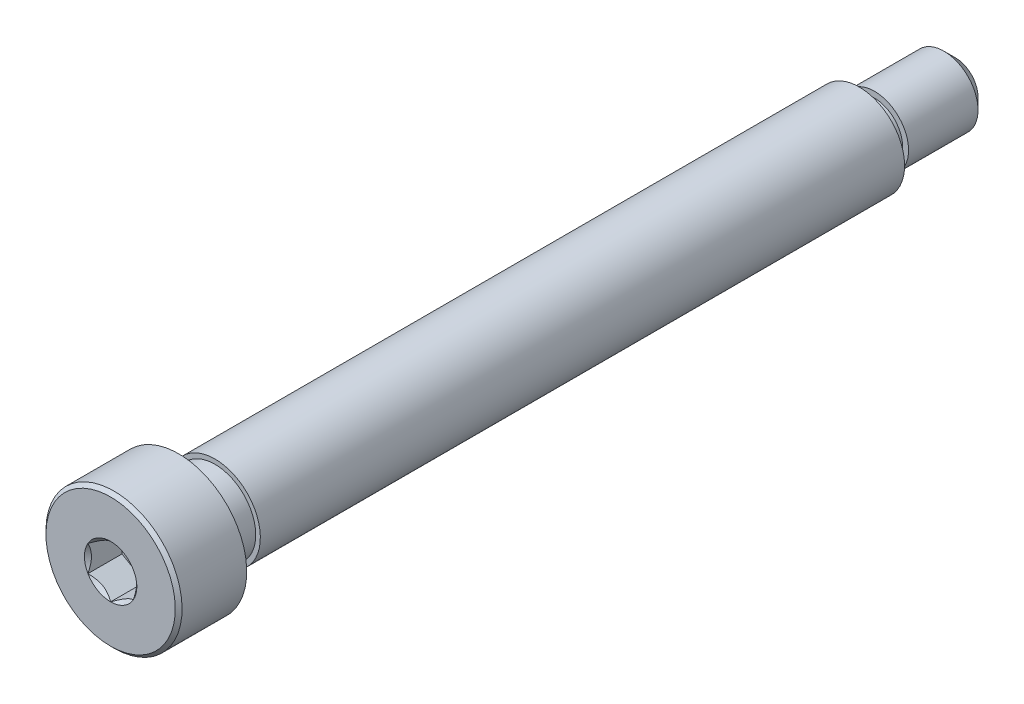
ISO-10303-21;
HEADER;
FILE_DESCRIPTION(('STEP AP214'),'2;1');
FILE_NAME('part.step','',(''),(''),'','','');
FILE_SCHEMA(('AUTOMOTIVE_DESIGN { 1 0 10303 214 1 1 1 1 }'));
ENDSEC;
DATA;
#1=APPLICATION_CONTEXT('core data for automotive mechanical design processes');
#2=APPLICATION_PROTOCOL_DEFINITION('international standard','automotive_design',2000,#1);
#3=PRODUCT_CONTEXT('',#1,'mechanical');
#4=PRODUCT('Part','Part','',(#3));
#5=PRODUCT_RELATED_PRODUCT_CATEGORY('part','',(#4));
#6=PRODUCT_DEFINITION_FORMATION('','',#4);
#7=PRODUCT_DEFINITION_CONTEXT('part definition',#1,'design');
#8=PRODUCT_DEFINITION('design','',#6,#7);
#9=PRODUCT_DEFINITION_SHAPE('','',#8);
#10=(LENGTH_UNIT() NAMED_UNIT(*) SI_UNIT(.MILLI.,.METRE.));
#11=(NAMED_UNIT(*) PLANE_ANGLE_UNIT() SI_UNIT($,.RADIAN.));
#12=(NAMED_UNIT(*) SI_UNIT($,.STERADIAN.) SOLID_ANGLE_UNIT());
#13=UNCERTAINTY_MEASURE_WITH_UNIT(LENGTH_MEASURE(1.E-05),#10,'distance_accuracy_value','');
#14=(GEOMETRIC_REPRESENTATION_CONTEXT(3) GLOBAL_UNCERTAINTY_ASSIGNED_CONTEXT((#13)) GLOBAL_UNIT_ASSIGNED_CONTEXT((#10,
#11,#12)) REPRESENTATION_CONTEXT('',''));
#15=CARTESIAN_POINT('',(0.,0.,0.));
#16=DIRECTION('',(0.,0.,1.));
#17=DIRECTION('',(1.,0.,0.));
#18=AXIS2_PLACEMENT_3D('',#15,#16,#17);
#19=CARTESIAN_POINT('',(0.,0.,18.621));
#20=DIRECTION('',(0.,0.,1.));
#21=DIRECTION('',(0.,-1.,0.));
#22=AXIS2_PLACEMENT_3D('',#19,#20,#21);
#23=CYLINDRICAL_SURFACE('',#22,3.);
#24=CARTESIAN_POINT('',(0.,0.,15.621));
#25=DIRECTION('',(0.,0.,1.));
#26=DIRECTION('',(0.,-1.,0.));
#27=AXIS2_PLACEMENT_3D('',#24,#25,#26);
#28=CIRCLE('',#27,3.);
#29=CARTESIAN_POINT('',(0.,-3.,15.621));
#30=VERTEX_POINT('',#29);
#31=EDGE_CURVE('E172',#30,#30,#28,.T.);
#32=ORIENTED_EDGE('',*,*,#31,.T.);
#33=EDGE_LOOP('',(#32));
#34=FACE_BOUND('',#33,.T.);
#35=CARTESIAN_POINT('',(0.,0.,18.471));
#36=DIRECTION('',(0.,0.,1.));
#37=DIRECTION('',(0.,-1.,0.));
#38=AXIS2_PLACEMENT_3D('',#35,#36,#37);
#39=CIRCLE('',#38,3.);
#40=CARTESIAN_POINT('',(0.,-3.,18.471));
#41=VERTEX_POINT('',#40);
#42=EDGE_CURVE('E425',#41,#41,#39,.T.);
#43=ORIENTED_EDGE('',*,*,#42,.F.);
#44=EDGE_LOOP('',(#43));
#45=FACE_BOUND('',#44,.T.);
#46=ADVANCED_FACE('F45',(#34,#45),#23,.T.);
#47=CARTESIAN_POINT('',(0.,2.,-14.379));
#48=DIRECTION('',(0.,0.,1.));
#49=DIRECTION('',(0.,-1.,0.));
#50=AXIS2_PLACEMENT_3D('',#47,#48,#49);
#51=PLANE('',#50);
#52=CARTESIAN_POINT('',(0.,0.,-14.379));
#53=DIRECTION('',(0.,0.,1.));
#54=DIRECTION('',(0.,-1.,0.));
#55=AXIS2_PLACEMENT_3D('',#52,#53,#54);
#56=CIRCLE('',#55,1.36904775);
#57=CARTESIAN_POINT('',(0.,-1.36904775,-14.379));
#58=VERTEX_POINT('',#57);
#59=EDGE_CURVE('E145',#58,#58,#56,.T.);
#60=ORIENTED_EDGE('',*,*,#59,.T.);
#61=EDGE_LOOP('',(#60));
#62=FACE_BOUND('',#61,.T.);
#63=CARTESIAN_POINT('',(0.,0.,-14.379));
#64=DIRECTION('',(0.,0.,1.));
#65=DIRECTION('',(0.,-1.,0.));
#66=AXIS2_PLACEMENT_3D('',#63,#64,#65);
#67=CIRCLE('',#66,1.5);
#68=CARTESIAN_POINT('',(0.,-1.5,-14.379));
#69=VERTEX_POINT('',#68);
#70=EDGE_CURVE('E165',#69,#69,#67,.T.);
#71=ORIENTED_EDGE('',*,*,#70,.F.);
#72=EDGE_LOOP('',(#71));
#73=FACE_BOUND('',#72,.T.);
#74=ADVANCED_FACE('F255',(#62,#73),#51,.F.);
#75=CARTESIAN_POINT('',(0.,1.5,-18.621));
#76=DIRECTION('',(0.,0.,1.));
#77=DIRECTION('',(0.,-1.,0.));
#78=AXIS2_PLACEMENT_3D('',#75,#76,#77);
#79=PLANE('',#78);
#80=CARTESIAN_POINT('',(0.,0.,-18.621));
#81=DIRECTION('',(0.,0.,1.));
#82=DIRECTION('',(0.,-1.,0.));
#83=AXIS2_PLACEMENT_3D('',#80,#81,#82);
#84=CIRCLE('',#83,0.993851983499987);
#85=CARTESIAN_POINT('',(0.,-0.993851983499987,-18.621));
#86=VERTEX_POINT('',#85);
#87=EDGE_CURVE('E12',#86,#86,#84,.F.);
#88=ORIENTED_EDGE('',*,*,#87,.T.);
#89=EDGE_LOOP('',(#88));
#90=FACE_BOUND('',#89,.T.);
#91=ADVANCED_FACE('F263',(#90),#79,.F.);
#92=CARTESIAN_POINT('',(0.,0.,18.621));
#93=DIRECTION('',(0.,0.,1.));
#94=DIRECTION('',(0.,-1.,0.));
#95=AXIS2_PLACEMENT_3D('',#92,#93,#94);
#96=CYLINDRICAL_SURFACE('',#95,1.5);
#97=CARTESIAN_POINT('',(0.,0.,-18.1148519835));
#98=DIRECTION('',(0.,0.,1.));
#99=DIRECTION('',(0.,-1.,0.));
#100=AXIS2_PLACEMENT_3D('',#97,#98,#99);
#101=CIRCLE('',#100,1.5);
#102=CARTESIAN_POINT('',(0.,-1.5,-18.1148519835));
#103=VERTEX_POINT('',#102);
#104=EDGE_CURVE('E53',#103,#103,#101,.T.);
#105=ORIENTED_EDGE('',*,*,#104,.T.);
#106=EDGE_LOOP('',(#105));
#107=FACE_BOUND('',#106,.T.);
#108=CARTESIAN_POINT('',(0.,0.,-15.053864022));
#109=DIRECTION('',(0.,0.,1.));
#110=DIRECTION('',(0.,-1.,0.));
#111=AXIS2_PLACEMENT_3D('',#108,#109,#110);
#112=CIRCLE('',#111,1.5);
#113=CARTESIAN_POINT('',(0.,-1.5,-15.053864022));
#114=VERTEX_POINT('',#113);
#115=EDGE_CURVE('E156',#114,#114,#112,.T.);
#116=ORIENTED_EDGE('',*,*,#115,.F.);
#117=EDGE_LOOP('',(#116));
#118=FACE_BOUND('',#117,.T.);
#119=ADVANCED_FACE('F448',(#107,#118),#96,.T.);
#120=CARTESIAN_POINT('',(0.,1.2380955,-15.053864022));
#121=DIRECTION('',(0.,0.,-1.));
#122=DIRECTION('',(0.,1.,0.));
#123=AXIS2_PLACEMENT_3D('',#120,#121,#122);
#124=PLANE('',#123);
#125=CARTESIAN_POINT('',(0.,0.,-15.053864022));
#126=DIRECTION('',(0.,0.,1.));
#127=DIRECTION('',(0.,-1.,0.));
#128=AXIS2_PLACEMENT_3D('',#125,#126,#127);
#129=CIRCLE('',#128,1.2380955);
#130=CARTESIAN_POINT('',(0.,-1.2380955,-15.053864022));
#131=VERTEX_POINT('',#130);
#132=EDGE_CURVE('E159',#131,#131,#129,.T.);
#133=ORIENTED_EDGE('',*,*,#132,.F.);
#134=EDGE_LOOP('',(#133));
#135=FACE_BOUND('',#134,.T.);
#136=ORIENTED_EDGE('',*,*,#115,.T.);
#137=EDGE_LOOP('',(#136));
#138=FACE_BOUND('',#137,.T.);
#139=ADVANCED_FACE('F302',(#135,#138),#124,.F.);
#140=CARTESIAN_POINT('',(0.,0.,18.621));
#141=DIRECTION('',(0.,0.,1.));
#142=DIRECTION('',(0.,-1.,0.));
#143=AXIS2_PLACEMENT_3D('',#140,#141,#142);
#144=CYLINDRICAL_SURFACE('',#143,1.2380955);
#145=CARTESIAN_POINT('',(0.,0.,-14.50995225));
#146=DIRECTION('',(0.,0.,1.));
#147=DIRECTION('',(0.,-1.,0.));
#148=AXIS2_PLACEMENT_3D('',#145,#146,#147);
#149=CIRCLE('',#148,1.2380955);
#150=CARTESIAN_POINT('',(0.,-1.2380955,-14.50995225));
#151=VERTEX_POINT('',#150);
#152=EDGE_CURVE('E162',#151,#151,#149,.T.);
#153=ORIENTED_EDGE('',*,*,#152,.F.);
#154=EDGE_LOOP('',(#153));
#155=FACE_BOUND('',#154,.T.);
#156=ORIENTED_EDGE('',*,*,#132,.T.);
#157=EDGE_LOOP('',(#156));
#158=FACE_BOUND('',#157,.T.);
#159=ADVANCED_FACE('F289',(#155,#158),#144,.T.);
#160=CARTESIAN_POINT('',(0.,0.,-14.50995225));
#161=DIRECTION('',(0.,0.,1.));
#162=DIRECTION('',(0.,-1.,0.));
#163=AXIS2_PLACEMENT_3D('',#160,#161,#162);
#164=TOROIDAL_SURFACE('',#163,1.36904775,0.13095225);
#165=ORIENTED_EDGE('',*,*,#59,.F.);
#166=EDGE_LOOP('',(#165));
#167=FACE_BOUND('',#166,.T.);
#168=ORIENTED_EDGE('',*,*,#152,.T.);
#169=EDGE_LOOP('',(#168));
#170=FACE_BOUND('',#169,.T.);
#171=ADVANCED_FACE('F284',(#167,#170),#164,.F.);
#172=CARTESIAN_POINT('',(0.,0.,-14.379));
#173=DIRECTION('',(0.,0.,-1.));
#174=DIRECTION('',(0.,1.,0.));
#175=AXIS2_PLACEMENT_3D('',#172,#173,#174);
#176=CONICAL_SURFACE('',#175,1.5,1.56033896152627);
#177=CARTESIAN_POINT('',(0.,0.,-14.378601581645));
#178=DIRECTION('',(0.,0.,1.));
#179=DIRECTION('',(0.,-1.,0.));
#180=AXIS2_PLACEMENT_3D('',#177,#178,#179);
#181=CIRCLE('',#180,1.46190208322212);
#182=CARTESIAN_POINT('',(0.,-1.46190208322212,-14.378601581645));
#183=VERTEX_POINT('',#182);
#184=EDGE_CURVE('E175',#183,#183,#181,.T.);
#185=ORIENTED_EDGE('',*,*,#184,.F.);
#186=EDGE_LOOP('',(#185));
#187=FACE_BOUND('',#186,.T.);
#188=ORIENTED_EDGE('',*,*,#70,.T.);
#189=EDGE_LOOP('',(#188));
#190=FACE_BOUND('',#189,.T.);
#191=ADVANCED_FACE('F281',(#187,#190),#176,.T.);
#192=CARTESIAN_POINT('',(0.,0.,14.021398418355));
#193=DIRECTION('',(0.,0.,-1.));
#194=DIRECTION('',(0.,1.,0.));
#195=AXIS2_PLACEMENT_3D('',#192,#193,#194);
#196=CONICAL_SURFACE('',#195,1.75890208322212,1.56033896152627);
#197=CARTESIAN_POINT('',(0.,0.,14.021));
#198=DIRECTION('',(0.,0.,1.));
#199=DIRECTION('',(0.,-1.,0.));
#200=AXIS2_PLACEMENT_3D('',#197,#198,#199);
#201=CIRCLE('',#200,1.797);
#202=CARTESIAN_POINT('',(0.,-1.797,14.021));
#203=VERTEX_POINT('',#202);
#204=EDGE_CURVE('E171',#203,#203,#201,.T.);
#205=ORIENTED_EDGE('',*,*,#204,.F.);
#206=EDGE_LOOP('',(#205));
#207=FACE_BOUND('',#206,.T.);
#208=CARTESIAN_POINT('',(0.,0.,14.021398418355));
#209=DIRECTION('',(0.,0.,1.));
#210=DIRECTION('',(0.,-1.,0.));
#211=AXIS2_PLACEMENT_3D('',#208,#209,#210);
#212=CIRCLE('',#211,1.75890208322212);
#213=CARTESIAN_POINT('',(0.,-1.75890208322212,14.021398418355));
#214=VERTEX_POINT('',#213);
#215=EDGE_CURVE('E176',#214,#214,#212,.T.);
#216=ORIENTED_EDGE('',*,*,#215,.T.);
#217=EDGE_LOOP('',(#216));
#218=FACE_BOUND('',#217,.T.);
#219=ADVANCED_FACE('F277',(#207,#218),#196,.F.);
#220=CARTESIAN_POINT('',(0.,0.,14.021398418355));
#221=DIRECTION('',(0.,0.,1.));
#222=DIRECTION('',(0.,-1.,0.));
#223=AXIS2_PLACEMENT_3D('',#220,#221,#222);
#224=CONICAL_SURFACE('',#223,1.75890208322212,0.010457365268617);
#225=ORIENTED_EDGE('',*,*,#184,.T.);
#226=EDGE_LOOP('',(#225));
#227=FACE_BOUND('',#226,.T.);
#228=ORIENTED_EDGE('',*,*,#215,.F.);
#229=EDGE_LOOP('',(#228));
#230=FACE_BOUND('',#229,.T.);
#231=ADVANCED_FACE('F274',(#227,#230),#224,.T.);
#232=CARTESIAN_POINT('',(0.,3.,15.621));
#233=DIRECTION('',(0.,0.,1.));
#234=DIRECTION('',(0.,-1.,0.));
#235=AXIS2_PLACEMENT_3D('',#232,#233,#234);
#236=PLANE('',#235);
#237=ORIENTED_EDGE('',*,*,#31,.F.);
#238=EDGE_LOOP('',(#237));
#239=FACE_BOUND('',#238,.T.);
#240=CARTESIAN_POINT('',(0.,0.,15.621));
#241=DIRECTION('',(0.,0.,1.));
#242=DIRECTION('',(0.,-1.,0.));
#243=AXIS2_PLACEMENT_3D('',#240,#241,#242);
#244=CIRCLE('',#243,1.797);
#245=CARTESIAN_POINT('',(0.,-1.797,15.621));
#246=VERTEX_POINT('',#245);
#247=EDGE_CURVE('E168',#246,#246,#244,.T.);
#248=ORIENTED_EDGE('',*,*,#247,.T.);
#249=EDGE_LOOP('',(#248));
#250=FACE_BOUND('',#249,.T.);
#251=ADVANCED_FACE('F268',(#239,#250),#236,.F.);
#252=CARTESIAN_POINT('',(0.,0.,18.621));
#253=DIRECTION('',(0.,0.,1.));
#254=DIRECTION('',(0.,-1.,0.));
#255=AXIS2_PLACEMENT_3D('',#252,#253,#254);
#256=CYLINDRICAL_SURFACE('',#255,1.797);
#257=ORIENTED_EDGE('',*,*,#247,.F.);
#258=EDGE_LOOP('',(#257));
#259=FACE_BOUND('',#258,.T.);
#260=ORIENTED_EDGE('',*,*,#204,.T.);
#261=EDGE_LOOP('',(#260));
#262=FACE_BOUND('',#261,.T.);
#263=ADVANCED_FACE('F308',(#259,#262),#256,.T.);
#264=CARTESIAN_POINT('',(0.,0.,-18.1148519835));
#265=DIRECTION('',(0.,0.,1.));
#266=DIRECTION('',(0.,-1.,0.));
#267=AXIS2_PLACEMENT_3D('',#264,#265,#266);
#268=CONICAL_SURFACE('',#267,1.5,0.785398163397455);
#269=ORIENTED_EDGE('',*,*,#87,.F.);
#270=EDGE_LOOP('',(#269));
#271=FACE_BOUND('',#270,.T.);
#272=ORIENTED_EDGE('',*,*,#104,.F.);
#273=EDGE_LOOP('',(#272));
#274=FACE_BOUND('',#273,.T.);
#275=ADVANCED_FACE('F47',(#271,#274),#268,.T.);
#276=CARTESIAN_POINT('',(0.,0.,18.621));
#277=DIRECTION('',(0.,0.,-1.));
#278=DIRECTION('',(0.,1.,0.));
#279=AXIS2_PLACEMENT_3D('',#276,#277,#278);
#280=CONICAL_SURFACE('',#279,2.85,0.785398163397445);
#281=ORIENTED_EDGE('',*,*,#42,.T.);
#282=EDGE_LOOP('',(#281));
#283=FACE_BOUND('',#282,.T.);
#284=CARTESIAN_POINT('',(0.,0.,18.621));
#285=DIRECTION('',(0.,0.,1.));
#286=DIRECTION('',(0.,-1.,0.));
#287=AXIS2_PLACEMENT_3D('',#284,#285,#286);
#288=CIRCLE('',#287,2.85);
#289=CARTESIAN_POINT('',(0.,-2.85,18.621));
#290=VERTEX_POINT('',#289);
#291=EDGE_CURVE('E428',#290,#290,#288,.T.);
#292=ORIENTED_EDGE('',*,*,#291,.F.);
#293=EDGE_LOOP('',(#292));
#294=FACE_BOUND('',#293,.T.);
#295=ADVANCED_FACE('F201',(#283,#294),#280,.T.);
#296=CARTESIAN_POINT('',(0.,0.,17.121));
#297=DIRECTION('',(0.,0.,1.));
#298=DIRECTION('',(1.,0.,0.));
#299=AXIS2_PLACEMENT_3D('',#296,#297,#298);
#300=PLANE('',#299);
#301=DIRECTION('',(-0.866025403784439,0.499999999999999,0.));
#302=VECTOR('',#301,1.);
#303=CARTESIAN_POINT('',(1.,0.577350269189626,17.121));
#304=LINE('',#303,#302);
#305=CARTESIAN_POINT('',(1.,0.577350269189626,17.121));
#306=VERTEX_POINT('',#305);
#307=CARTESIAN_POINT('',(0.,1.15470053837925,17.121));
#308=VERTEX_POINT('',#307);
#309=EDGE_CURVE('E104',#306,#308,#304,.T.);
#310=ORIENTED_EDGE('',*,*,#309,.T.);
#311=DIRECTION('',(-0.866025403784438,-0.5,0.));
#312=VECTOR('',#311,1.);
#313=CARTESIAN_POINT('',(0.,1.15470053837925,17.121));
#314=LINE('',#313,#312);
#315=CARTESIAN_POINT('',(-1.,0.577350269189625,17.121));
#316=VERTEX_POINT('',#315);
#317=EDGE_CURVE('E114',#308,#316,#314,.T.);
#318=ORIENTED_EDGE('',*,*,#317,.T.);
#319=DIRECTION('',(0.,-1.,0.));
#320=VECTOR('',#319,1.);
#321=CARTESIAN_POINT('',(-1.,0.577350269189625,17.121));
#322=LINE('',#321,#320);
#323=CARTESIAN_POINT('',(-1.,-0.577350269189626,17.121));
#324=VERTEX_POINT('',#323);
#325=EDGE_CURVE('E120',#316,#324,#322,.T.);
#326=ORIENTED_EDGE('',*,*,#325,.T.);
#327=DIRECTION('',(0.866025403784439,-0.499999999999999,0.));
#328=VECTOR('',#327,1.);
#329=CARTESIAN_POINT('',(-1.,-0.577350269189626,17.121));
#330=LINE('',#329,#328);
#331=CARTESIAN_POINT('',(0.,-1.15470053837925,17.121));
#332=VERTEX_POINT('',#331);
#333=EDGE_CURVE('E137',#324,#332,#330,.T.);
#334=ORIENTED_EDGE('',*,*,#333,.T.);
#335=DIRECTION('',(0.866025403784438,0.5,0.));
#336=VECTOR('',#335,1.);
#337=CARTESIAN_POINT('',(0.,-1.15470053837925,17.121));
#338=LINE('',#337,#336);
#339=CARTESIAN_POINT('',(1.,-0.577350269189625,17.121));
#340=VERTEX_POINT('',#339);
#341=EDGE_CURVE('E140',#332,#340,#338,.T.);
#342=ORIENTED_EDGE('',*,*,#341,.T.);
#343=DIRECTION('',(0.,1.,0.));
#344=VECTOR('',#343,1.);
#345=CARTESIAN_POINT('',(1.,-0.577350269189625,17.121));
#346=LINE('',#345,#344);
#347=EDGE_CURVE('E111',#340,#306,#346,.T.);
#348=ORIENTED_EDGE('',*,*,#347,.T.);
#349=EDGE_LOOP('',(#310,#318,#326,#334,#342,#348));
#350=FACE_BOUND('',#349,.T.);
#351=ADVANCED_FACE('F122',(#350),#300,.T.);
#352=CARTESIAN_POINT('',(-1.,0.577350269189625,17.121));
#353=DIRECTION('',(-1.,0.,0.));
#354=DIRECTION('',(0.,-1.,0.));
#355=AXIS2_PLACEMENT_3D('',#352,#353,#354);
#356=PLANE('',#355);
#357=DIRECTION('',(0.,0.,1.));
#358=VECTOR('',#357,1.);
#359=CARTESIAN_POINT('',(-1.,0.577350269189625,17.121));
#360=LINE('',#359,#358);
#361=CARTESIAN_POINT('',(-0.999999999999999,0.577350269189626,18.621));
#362=VERTEX_POINT('',#361);
#363=EDGE_CURVE('E110',#316,#362,#360,.T.);
#364=ORIENTED_EDGE('',*,*,#363,.T.);
#365=CARTESIAN_POINT('',(-1.,-1.15147208646462,18.9913856775139));
#366=CARTESIAN_POINT('',(-1.,-1.12343447988552,18.9702199198737));
#367=CARTESIAN_POINT('',(-1.,-1.09524064850697,18.9492616921759));
#368=CARTESIAN_POINT('',(-1.,-1.03847715644376,18.9078460222356));
#369=CARTESIAN_POINT('',(-1.,-1.00990740382975,18.8873887061237));
#370=CARTESIAN_POINT('',(-1.,-0.923120894333479,18.8266047949545));
#371=CARTESIAN_POINT('',(-1.,-0.86425317375906,18.7871922289614));
#372=CARTESIAN_POINT('',(-1.,-0.740809858258045,18.7098206642002));
#373=CARTESIAN_POINT('',(-1.,-0.676100255137807,18.6720730391143));
#374=CARTESIAN_POINT('',(-1.,-0.543448939049125,18.6030245875513));
#375=CARTESIAN_POINT('',(-1.,-0.475519112027779,18.5717020278469));
#376=CARTESIAN_POINT('',(-1.,-0.373555850333529,18.5333817788838));
#377=CARTESIAN_POINT('',(-1.,-0.341031989670908,18.5223835916422));
#378=CARTESIAN_POINT('',(-1.,-0.275199079052293,18.5029983421474));
#379=CARTESIAN_POINT('',(-1.,-0.241889975173933,18.4946114597767));
#380=CARTESIAN_POINT('',(-1.,-0.175247517042993,18.481025220719));
#381=CARTESIAN_POINT('',(-1.,-0.141925568218175,18.475770790768));
#382=CARTESIAN_POINT('',(-1.,-0.0749144362322795,18.4685486865709));
#383=CARTESIAN_POINT('',(-1.,-0.0412251978501623,18.4665815136105));
#384=CARTESIAN_POINT('',(-1.,0.0249580992634202,18.4660831983932));
#385=CARTESIAN_POINT('',(-1.,0.0574512826460383,18.4674302678886));
#386=CARTESIAN_POINT('',(-1.,0.122148505701866,18.473216484499));
#387=CARTESIAN_POINT('',(-1.,0.154352610132925,18.4776549206615));
#388=CARTESIAN_POINT('',(-1.,0.218799898867638,18.4894568301452));
#389=CARTESIAN_POINT('',(-1.,0.251033743268952,18.4968705410385));
#390=CARTESIAN_POINT('',(-1.,0.314797132354918,18.5142289424987));
#391=CARTESIAN_POINT('',(-1.,0.346326735731003,18.5241734212888));
#392=CARTESIAN_POINT('',(-1.,0.445594187730204,18.5592234825543));
#393=CARTESIAN_POINT('',(-1.,0.511919139476036,18.5883208583567));
#394=CARTESIAN_POINT('',(-1.,0.641453244657532,18.6530153296865));
#395=CARTESIAN_POINT('',(-1.,0.704650133126344,18.6886357767152));
#396=CARTESIAN_POINT('',(-1.,0.825428490174986,18.7621239013469));
#397=CARTESIAN_POINT('',(-1.,0.883132947867685,18.7997919471355));
#398=CARTESIAN_POINT('',(-1.,0.968148853704565,18.8580228529432));
#399=CARTESIAN_POINT('',(-1.,0.996120570380285,18.8776384757629));
#400=CARTESIAN_POINT('',(-1.,1.05168177729901,18.9173885170613));
#401=CARTESIAN_POINT('',(-1.,1.079271369977,18.9375227921988));
#402=CARTESIAN_POINT('',(-1.,1.10670185346329,18.957872119073));
#403=B_SPLINE_CURVE_WITH_KNOTS('',3,(#365,#366,#367,#368,#369,#370,#371,#372,#373,#374,#375,
#376,#377,#378,#379,#380,#381,#382,#383,#384,#385,#386,#387,#388,#389,#390,#391,#392,#393,#394,
#395,#396,#397,#398,#399,#400,#401,#402),.UNSPECIFIED.,.F.,.F.,(4,2,2,2,2,2,2,2,2,2,2,2,2,2,2,2,
2,2,4),(0.,0.105386459083289,0.210799187330123,0.423233611565468,0.647793540908503,
0.871580877738609,0.97449307418142,1.07741235827201,1.17846428203205,1.27953161415762,
1.3769408673961,1.47432772585408,1.57343322804293,1.67253043972851,1.88917353996827,
2.10660791038813,2.31323734249843,2.41572589232044,2.51818641476503),.UNSPECIFIED.);
#404=CARTESIAN_POINT('',(-1.,-0.577350269189626,18.621));
#405=VERTEX_POINT('',#404);
#406=EDGE_CURVE('E208',#362,#405,#403,.F.);
#407=ORIENTED_EDGE('',*,*,#406,.T.);
#408=DIRECTION('',(0.,0.,1.));
#409=VECTOR('',#408,1.);
#410=CARTESIAN_POINT('',(-1.,-0.577350269189626,17.121));
#411=LINE('',#410,#409);
#412=EDGE_CURVE('E152',#324,#405,#411,.T.);
#413=ORIENTED_EDGE('',*,*,#412,.F.);
#414=ORIENTED_EDGE('',*,*,#325,.F.);
#415=EDGE_LOOP('',(#364,#407,#413,#414));
#416=FACE_BOUND('',#415,.T.);
#417=ADVANCED_FACE('F245',(#416),#356,.F.);
#418=CARTESIAN_POINT('',(-1.,-0.577350269189626,17.121));
#419=DIRECTION('',(-0.499999999999999,-0.866025403784439,0.));
#420=DIRECTION('',(0.866025403784439,-0.499999999999999,0.));
#421=AXIS2_PLACEMENT_3D('',#418,#419,#420);
#422=PLANE('',#421);
#423=ORIENTED_EDGE('',*,*,#412,.T.);
#424=CARTESIAN_POINT('',(-1.0002,-0.577234799135788,18.6211154873726));
#425=CARTESIAN_POINT('',(-0.965817404992819,-0.597085599618622,18.6012779308257));
#426=CARTESIAN_POINT('',(-0.930859881860175,-0.617268335009456,18.5826050206389));
#427=CARTESIAN_POINT('',(-0.85957719704391,-0.658423412276686,18.5484147427232));
#428=CARTESIAN_POINT('',(-0.823245249471016,-0.67939967198808,18.5329164090235));
#429=CARTESIAN_POINT('',(-0.749983386196689,-0.721697428470846,18.5063673071423));
#430=CARTESIAN_POINT('',(-0.713072148554585,-0.743008141459637,18.4952497739969));
#431=CARTESIAN_POINT('',(-0.63843727068914,-0.786098608286186,18.4781198657762));
#432=CARTESIAN_POINT('',(-0.600715911891364,-0.807877044942281,18.4720946974667));
#433=CARTESIAN_POINT('',(-0.535707801582066,-0.845409494928863,18.4666605549675));
#434=CARTESIAN_POINT('',(-0.508505628471827,-0.861114676896602,18.4658569383167));
#435=CARTESIAN_POINT('',(-0.454153959330887,-0.892494627706029,18.4672066994169));
#436=CARTESIAN_POINT('',(-0.427004476245124,-0.908169389073954,18.4693607295472));
#437=CARTESIAN_POINT('',(-0.345943722673039,-0.95496983696951,18.4801169721285));
#438=CARTESIAN_POINT('',(-0.292435859021572,-0.985862616452447,18.4930145564154));
#439=CARTESIAN_POINT('',(-0.198523934856568,-1.04008269114923,18.5241407306022));
#440=CARTESIAN_POINT('',(-0.157679476328165,-1.06366425027551,18.5407377977018));
#441=CARTESIAN_POINT('',(-0.0775903626180552,-1.1099037216352,18.5781249246853));
#442=CARTESIAN_POINT('',(-0.0383409891295611,-1.1325643579843,18.5989013418174));
#443=CARTESIAN_POINT('',(0.000200000000000427,-1.15481600843309,18.6211154873726));
#444=B_SPLINE_CURVE_WITH_KNOTS('',3,(#424,#425,#426,#427,#428,#429,#430,#431,#432,#433,#434,
#435,#436,#437,#438,#439,#440,#441,#442,#443),.UNSPECIFIED.,.F.,.F.,(4,2,2,2,2,2,2,2,2,4),(0.,
0.133237676828558,0.267252229834489,0.399137076269299,0.530689603280768,0.624814864263846,
0.718960890149133,0.907306626112097,1.05710100361789,1.20641411519286),.UNSPECIFIED.);
#445=CARTESIAN_POINT('',(0.,-1.15470053837925,18.621));
#446=VERTEX_POINT('',#445);
#447=EDGE_CURVE('E216',#405,#446,#444,.T.);
#448=ORIENTED_EDGE('',*,*,#447,.T.);
#449=DIRECTION('',(0.,0.,1.));
#450=VECTOR('',#449,1.);
#451=CARTESIAN_POINT('',(0.,-1.15470053837925,17.121));
#452=LINE('',#451,#450);
#453=EDGE_CURVE('E149',#332,#446,#452,.T.);
#454=ORIENTED_EDGE('',*,*,#453,.F.);
#455=ORIENTED_EDGE('',*,*,#333,.F.);
#456=EDGE_LOOP('',(#423,#448,#454,#455));
#457=FACE_BOUND('',#456,.T.);
#458=ADVANCED_FACE('F241',(#457),#422,.F.);
#459=CARTESIAN_POINT('',(0.,-1.15470053837925,17.121));
#460=DIRECTION('',(0.5,-0.866025403784438,0.));
#461=DIRECTION('',(0.866025403784439,0.5,0.));
#462=AXIS2_PLACEMENT_3D('',#459,#460,#461);
#463=PLANE('',#462);
#464=ORIENTED_EDGE('',*,*,#453,.T.);
#465=CARTESIAN_POINT('',(-0.000199999999999206,-1.15481600843309,18.6211154873726));
#466=CARTESIAN_POINT('',(0.0341825950071805,-1.13496520795026,18.6012779308257));
#467=CARTESIAN_POINT('',(0.0691401181398245,-1.11478247255942,18.5826050206389));
#468=CARTESIAN_POINT('',(0.140422802956089,-1.07362739529219,18.5484147427232));
#469=CARTESIAN_POINT('',(0.176754750528984,-1.0526511355808,18.5329164090235));
#470=CARTESIAN_POINT('',(0.250016613803311,-1.01035337909803,18.5063673071423));
#471=CARTESIAN_POINT('',(0.286927851445414,-0.989042666109241,18.4952497739969));
#472=CARTESIAN_POINT('',(0.361562729310859,-0.945952199282691,18.4781198657762));
#473=CARTESIAN_POINT('',(0.399284088108636,-0.924173762626596,18.4720946974667));
#474=CARTESIAN_POINT('',(0.464292198417934,-0.886641312640014,18.4666605549675));
#475=CARTESIAN_POINT('',(0.491494371528173,-0.870936130672275,18.4658569383167));
#476=CARTESIAN_POINT('',(0.545846040669112,-0.839556179862848,18.4672066994169));
#477=CARTESIAN_POINT('',(0.572995523754876,-0.823881418494923,18.4693607295472));
#478=CARTESIAN_POINT('',(0.65405627732696,-0.777080970599366,18.4801169721285));
#479=CARTESIAN_POINT('',(0.707564140978428,-0.74618819111643,18.4930145564154));
#480=CARTESIAN_POINT('',(0.801476065143432,-0.691968116419649,18.5241407306022));
#481=CARTESIAN_POINT('',(0.842320523671835,-0.668386557293371,18.5407377977018));
#482=CARTESIAN_POINT('',(0.922409637381944,-0.622147085933681,18.5781249246853));
#483=CARTESIAN_POINT('',(0.961659010870438,-0.599486449584575,18.5989013418174));
#484=CARTESIAN_POINT('',(1.0002,-0.577234799135788,18.6211154873726));
#485=B_SPLINE_CURVE_WITH_KNOTS('',3,(#465,#466,#467,#468,#469,#470,#471,#472,#473,#474,#475,
#476,#477,#478,#479,#480,#481,#482,#483,#484),.UNSPECIFIED.,.F.,.F.,(4,2,2,2,2,2,2,2,2,4),(0.,
0.133237676828559,0.267252229834489,0.399137076269299,0.530689603280768,0.624814864263846,
0.718960890149132,0.907306626112097,1.05710100361789,1.20641411519286),.UNSPECIFIED.);
#486=CARTESIAN_POINT('',(1.,-0.577350269189626,18.621));
#487=VERTEX_POINT('',#486);
#488=EDGE_CURVE('E223',#446,#487,#485,.T.);
#489=ORIENTED_EDGE('',*,*,#488,.T.);
#490=DIRECTION('',(0.,0.,1.));
#491=VECTOR('',#490,1.);
#492=CARTESIAN_POINT('',(1.,-0.577350269189625,17.121));
#493=LINE('',#492,#491);
#494=EDGE_CURVE('E146',#340,#487,#493,.T.);
#495=ORIENTED_EDGE('',*,*,#494,.F.);
#496=ORIENTED_EDGE('',*,*,#341,.F.);
#497=EDGE_LOOP('',(#464,#489,#495,#496));
#498=FACE_BOUND('',#497,.T.);
#499=ADVANCED_FACE('F237',(#498),#463,.F.);
#500=CARTESIAN_POINT('',(1.,-0.577350269189625,17.121));
#501=DIRECTION('',(1.,0.,0.));
#502=DIRECTION('',(0.,1.,0.));
#503=AXIS2_PLACEMENT_3D('',#500,#501,#502);
#504=PLANE('',#503);
#505=ORIENTED_EDGE('',*,*,#494,.T.);
#506=CARTESIAN_POINT('',(1.,-1.15147208663215,18.9913856776403));
#507=CARTESIAN_POINT('',(1.,-1.12343448004835,18.9702199199953));
#508=CARTESIAN_POINT('',(1.,-1.09524064866509,18.9492616922927));
#509=CARTESIAN_POINT('',(1.,-1.0384771565924,18.9078460223427));
#510=CARTESIAN_POINT('',(1.,-1.00990740397362,18.8873887062259));
#511=CARTESIAN_POINT('',(1.,-0.923120894462773,18.8266047950421));
#512=CARTESIAN_POINT('',(1.,-0.864253173878443,18.7871922290393));
#513=CARTESIAN_POINT('',(1.,-0.74080985835581,18.7098206642582));
#514=CARTESIAN_POINT('',(1.,-0.676100255223807,18.6720730391622));
#515=CARTESIAN_POINT('',(1.,-0.543448939110597,18.6030245875803));
#516=CARTESIAN_POINT('',(1.,-0.475519112076495,18.5717020278671));
#517=CARTESIAN_POINT('',(1.,-0.373555850372648,18.5333817788976));
#518=CARTESIAN_POINT('',(1.,-0.341031989714046,18.5223835916562));
#519=CARTESIAN_POINT('',(1.,-0.275199079103602,18.5029983421611));
#520=CARTESIAN_POINT('',(1.,-0.241889975229392,18.4946114597899));
#521=CARTESIAN_POINT('',(1.,-0.175247517106616,18.4810252207301));
#522=CARTESIAN_POINT('',(1.,-0.141925568285809,18.4757707907776));
#523=CARTESIAN_POINT('',(1.,-0.0749144363078027,18.4685486865767));
#524=CARTESIAN_POINT('',(1.,-0.0412251979295645,18.4665815136139));
#525=CARTESIAN_POINT('',(1.,0.0249580991768624,18.4660831983911));
#526=CARTESIAN_POINT('',(1.,0.057451282556194,18.4674302678836));
#527=CARTESIAN_POINT('',(1.,0.122148505605777,18.4732164844874));
#528=CARTESIAN_POINT('',(1.,0.154352610033879,18.4776549206465));
#529=CARTESIAN_POINT('',(1.,0.218799898762753,18.4894568301229));
#530=CARTESIAN_POINT('',(1.,0.251033743161195,18.4968705410123));
#531=CARTESIAN_POINT('',(1.,0.314797132241692,18.5142289424647));
#532=CARTESIAN_POINT('',(1.,0.346326735615182,18.5241734212509));
#533=CARTESIAN_POINT('',(1.,0.445594187589162,18.5592234824979));
#534=CARTESIAN_POINT('',(1.,0.511919139313632,18.5883208582833));
#535=CARTESIAN_POINT('',(1.,0.641453244454045,18.6530153295771));
#536=CARTESIAN_POINT('',(1.,0.704650132903145,18.688635776587));
#537=CARTESIAN_POINT('',(1.,0.82542848991635,18.7621239011824));
#538=CARTESIAN_POINT('',(1.,0.883132947593197,18.7997919469538));
#539=CARTESIAN_POINT('',(1.,0.968148853406637,18.8580228527359));
#540=CARTESIAN_POINT('',(1.,0.996120570074655,18.8776384755472));
#541=CARTESIAN_POINT('',(1.,1.05168177697803,18.9173885168287));
#542=CARTESIAN_POINT('',(1.,1.07927136964837,18.9375227919578));
#543=CARTESIAN_POINT('',(1.,1.10670185312702,18.9578721188235));
#544=B_SPLINE_CURVE_WITH_KNOTS('',3,(#506,#507,#508,#509,#510,#511,#512,#513,#514,#515,#516,
#517,#518,#519,#520,#521,#522,#523,#524,#525,#526,#527,#528,#529,#530,#531,#532,#533,#534,#535,
#536,#537,#538,#539,#540,#541,#542,#543),.UNSPECIFIED.,.F.,.F.,(4,2,2,2,2,2,2,2,2,2,2,2,2,2,2,2,
2,2,4),(0.,0.10538645910335,0.210799187370248,0.423233611646472,0.647793541035349,
0.871580877910863,0.974493074342051,1.07741235842104,1.17846428216995,1.27953161428439,
1.37694086751269,1.47432772596047,1.57343322813834,1.67253043981295,1.88917353997385,
2.10660791031432,2.31323734235671,2.41572589214522,2.51818641455632),.UNSPECIFIED.);
#545=CARTESIAN_POINT('',(1.,0.577350269189624,18.621));
#546=VERTEX_POINT('',#545);
#547=EDGE_CURVE('E126',#487,#546,#544,.T.);
#548=ORIENTED_EDGE('',*,*,#547,.T.);
#549=DIRECTION('',(0.,0.,1.));
#550=VECTOR('',#549,1.);
#551=CARTESIAN_POINT('',(1.,0.577350269189626,17.121));
#552=LINE('',#551,#550);
#553=EDGE_CURVE('E143',#306,#546,#552,.T.);
#554=ORIENTED_EDGE('',*,*,#553,.F.);
#555=ORIENTED_EDGE('',*,*,#347,.F.);
#556=EDGE_LOOP('',(#505,#548,#554,#555));
#557=FACE_BOUND('',#556,.T.);
#558=ADVANCED_FACE('F234',(#557),#504,.F.);
#559=CARTESIAN_POINT('',(1.,0.577350269189626,17.121));
#560=DIRECTION('',(0.499999999999999,0.866025403784439,0.));
#561=DIRECTION('',(-0.866025403784439,0.499999999999999,0.));
#562=AXIS2_PLACEMENT_3D('',#559,#560,#561);
#563=PLANE('',#562);
#564=ORIENTED_EDGE('',*,*,#553,.T.);
#565=CARTESIAN_POINT('',(1.0002,0.577234799135788,18.6211154873726));
#566=CARTESIAN_POINT('',(0.96581740499282,0.597085599618621,18.6012779308257));
#567=CARTESIAN_POINT('',(0.930859881860177,0.617268335009456,18.5826050206389));
#568=CARTESIAN_POINT('',(0.859577197043912,0.658423412276685,18.5484147427232));
#569=CARTESIAN_POINT('',(0.823245249471017,0.679399671988079,18.5329164090235));
#570=CARTESIAN_POINT('',(0.74998338619669,0.721697428470845,18.5063673071423));
#571=CARTESIAN_POINT('',(0.713072148554587,0.743008141459636,18.4952497739969));
#572=CARTESIAN_POINT('',(0.638437270689142,0.786098608286185,18.4781198657762));
#573=CARTESIAN_POINT('',(0.600715911891366,0.80787704494228,18.4720946974667));
#574=CARTESIAN_POINT('',(0.535707801582068,0.845409494928862,18.4666605549675));
#575=CARTESIAN_POINT('',(0.508505628471829,0.861114676896601,18.4658569383167));
#576=CARTESIAN_POINT('',(0.454153959330889,0.892494627706028,18.4672066994169));
#577=CARTESIAN_POINT('',(0.427004476245126,0.908169389073953,18.4693607295472));
#578=CARTESIAN_POINT('',(0.345943722673041,0.95496983696951,18.4801169721285));
#579=CARTESIAN_POINT('',(0.292435859021574,0.985862616452446,18.4930145564154));
#580=CARTESIAN_POINT('',(0.19852393485657,1.04008269114923,18.5241407306022));
#581=CARTESIAN_POINT('',(0.157679476328167,1.0636642502755,18.5407377977018));
#582=CARTESIAN_POINT('',(0.0775903626180574,1.10990372163519,18.5781249246853));
#583=CARTESIAN_POINT('',(0.0383409891295631,1.1325643579843,18.5989013418174));
#584=CARTESIAN_POINT('',(-0.000199999999999836,1.15481600843309,18.6211154873726));
#585=B_SPLINE_CURVE_WITH_KNOTS('',3,(#565,#566,#567,#568,#569,#570,#571,#572,#573,#574,#575,
#576,#577,#578,#579,#580,#581,#582,#583,#584),.UNSPECIFIED.,.F.,.F.,(4,2,2,2,2,2,2,2,2,4),(0.,
0.133237676828558,0.26725222983449,0.3991370762693,0.530689603280768,0.624814864263846,
0.718960890149133,0.907306626112097,1.05710100361789,1.20641411519286),.UNSPECIFIED.);
#586=CARTESIAN_POINT('',(0.,1.15470053837925,18.621));
#587=VERTEX_POINT('',#586);
#588=EDGE_CURVE('E106',#546,#587,#585,.T.);
#589=ORIENTED_EDGE('',*,*,#588,.T.);
#590=DIRECTION('',(0.,0.,1.));
#591=VECTOR('',#590,1.);
#592=CARTESIAN_POINT('',(0.,1.15470053837925,17.121));
#593=LINE('',#592,#591);
#594=EDGE_CURVE('E99',#308,#587,#593,.T.);
#595=ORIENTED_EDGE('',*,*,#594,.F.);
#596=ORIENTED_EDGE('',*,*,#309,.F.);
#597=EDGE_LOOP('',(#564,#589,#595,#596));
#598=FACE_BOUND('',#597,.T.);
#599=ADVANCED_FACE('F102',(#598),#563,.F.);
#600=CARTESIAN_POINT('',(0.,1.15470053837925,17.121));
#601=DIRECTION('',(-0.5,0.866025403784438,0.));
#602=DIRECTION('',(-0.866025403784439,-0.5,0.));
#603=AXIS2_PLACEMENT_3D('',#600,#601,#602);
#604=PLANE('',#603);
#605=ORIENTED_EDGE('',*,*,#594,.T.);
#606=CARTESIAN_POINT('',(0.000199999999999905,1.15481600843309,18.6211154873726));
#607=CARTESIAN_POINT('',(-0.0341825950071802,1.13496520795026,18.6012779308257));
#608=CARTESIAN_POINT('',(-0.0691401181398239,1.11478247255942,18.5826050206389));
#609=CARTESIAN_POINT('',(-0.140422802956088,1.07362739529219,18.5484147427232));
#610=CARTESIAN_POINT('',(-0.176754750528983,1.0526511355808,18.5329164090235));
#611=CARTESIAN_POINT('',(-0.25001661380331,1.01035337909803,18.5063673071423));
#612=CARTESIAN_POINT('',(-0.286927851445413,0.989042666109241,18.4952497739969));
#613=CARTESIAN_POINT('',(-0.361562729310858,0.945952199282692,18.4781198657762));
#614=CARTESIAN_POINT('',(-0.399284088108635,0.924173762626597,18.4720946974667));
#615=CARTESIAN_POINT('',(-0.464292198417932,0.886641312640015,18.4666605549675));
#616=CARTESIAN_POINT('',(-0.491494371528171,0.870936130672276,18.4658569383167));
#617=CARTESIAN_POINT('',(-0.545846040669111,0.839556179862849,18.4672066994169));
#618=CARTESIAN_POINT('',(-0.572995523754874,0.823881418494924,18.4693607295472));
#619=CARTESIAN_POINT('',(-0.654056277326959,0.777080970599367,18.4801169721285));
#620=CARTESIAN_POINT('',(-0.707564140978426,0.746188191116431,18.4930145564154));
#621=CARTESIAN_POINT('',(-0.801476065143431,0.691968116419649,18.5241407306022));
#622=CARTESIAN_POINT('',(-0.842320523671835,0.668386557293371,18.5407377977018));
#623=CARTESIAN_POINT('',(-0.922409637381945,0.62214708593368,18.5781249246853));
#624=CARTESIAN_POINT('',(-0.961659010870439,0.599486449584574,18.5989013418174));
#625=CARTESIAN_POINT('',(-1.0002,0.577234799135787,18.6211154873726));
#626=B_SPLINE_CURVE_WITH_KNOTS('',3,(#606,#607,#608,#609,#610,#611,#612,#613,#614,#615,#616,
#617,#618,#619,#620,#621,#622,#623,#624,#625),.UNSPECIFIED.,.F.,.F.,(4,2,2,2,2,2,2,2,2,4),(0.,
0.133237676828558,0.26725222983449,0.3991370762693,0.530689603280768,0.624814864263846,
0.718960890149133,0.907306626112097,1.0571010036179,1.20641411519286),.UNSPECIFIED.);
#627=EDGE_CURVE('E185',#587,#362,#626,.T.);
#628=ORIENTED_EDGE('',*,*,#627,.T.);
#629=ORIENTED_EDGE('',*,*,#363,.F.);
#630=ORIENTED_EDGE('',*,*,#317,.F.);
#631=EDGE_LOOP('',(#605,#628,#629,#630));
#632=FACE_BOUND('',#631,.T.);
#633=ADVANCED_FACE('F115',(#632),#604,.F.);
#634=CARTESIAN_POINT('',(0.,0.,18.621));
#635=DIRECTION('',(0.,0.,1.));
#636=DIRECTION('',(1.,0.,0.));
#637=AXIS2_PLACEMENT_3D('',#634,#635,#636);
#638=CONICAL_SURFACE('',#637,1.15470053837925,0.78539816339745);
#639=CARTESIAN_POINT('',(0.,0.,18.621));
#640=DIRECTION('',(0.,0.,1.));
#641=DIRECTION('',(1.,0.,0.));
#642=AXIS2_PLACEMENT_3D('',#639,#640,#641);
#643=CIRCLE('',#642,1.15470053837925);
#644=EDGE_CURVE('E439',#362,#405,#643,.T.);
#645=ORIENTED_EDGE('',*,*,#644,.T.);
#646=ORIENTED_EDGE('',*,*,#406,.F.);
#647=EDGE_LOOP('',(#645,#646));
#648=FACE_BOUND('',#647,.T.);
#649=ADVANCED_FACE('F361',(#648),#638,.F.);
#650=EDGE_CURVE('E440',#405,#446,#643,.T.);
#651=ORIENTED_EDGE('',*,*,#650,.T.);
#652=ORIENTED_EDGE('',*,*,#447,.F.);
#653=EDGE_LOOP('',(#651,#652));
#654=FACE_BOUND('',#653,.T.);
#655=ADVANCED_FACE('F377',(#654),#638,.F.);
#656=EDGE_CURVE('E66',#446,#487,#643,.T.);
#657=ORIENTED_EDGE('',*,*,#656,.T.);
#658=ORIENTED_EDGE('',*,*,#488,.F.);
#659=EDGE_LOOP('',(#657,#658));
#660=FACE_BOUND('',#659,.T.);
#661=ADVANCED_FACE('F384',(#660),#638,.F.);
#662=EDGE_CURVE('E59',#487,#546,#643,.T.);
#663=ORIENTED_EDGE('',*,*,#662,.T.);
#664=ORIENTED_EDGE('',*,*,#547,.F.);
#665=EDGE_LOOP('',(#663,#664));
#666=FACE_BOUND('',#665,.T.);
#667=ADVANCED_FACE('F199',(#666),#638,.F.);
#668=EDGE_CURVE('E432',#546,#587,#643,.T.);
#669=ORIENTED_EDGE('',*,*,#668,.T.);
#670=ORIENTED_EDGE('',*,*,#588,.F.);
#671=EDGE_LOOP('',(#669,#670));
#672=FACE_BOUND('',#671,.T.);
#673=ADVANCED_FACE('F193',(#672),#638,.F.);
#674=EDGE_CURVE('E434',#587,#362,#643,.T.);
#675=ORIENTED_EDGE('',*,*,#674,.T.);
#676=ORIENTED_EDGE('',*,*,#627,.F.);
#677=EDGE_LOOP('',(#675,#676));
#678=FACE_BOUND('',#677,.T.);
#679=ADVANCED_FACE('F198',(#678),#638,.F.);
#680=CARTESIAN_POINT('',(0.,0.,18.621));
#681=DIRECTION('',(0.,0.,-1.));
#682=DIRECTION('',(0.,1.,0.));
#683=AXIS2_PLACEMENT_3D('',#680,#681,#682);
#684=PLANE('',#683);
#685=ORIENTED_EDGE('',*,*,#674,.F.);
#686=ORIENTED_EDGE('',*,*,#668,.F.);
#687=ORIENTED_EDGE('',*,*,#662,.F.);
#688=ORIENTED_EDGE('',*,*,#656,.F.);
#689=ORIENTED_EDGE('',*,*,#650,.F.);
#690=ORIENTED_EDGE('',*,*,#644,.F.);
#691=EDGE_LOOP('',(#685,#686,#687,#688,#689,#690));
#692=FACE_BOUND('',#691,.T.);
#693=ORIENTED_EDGE('',*,*,#291,.T.);
#694=EDGE_LOOP('',(#693));
#695=FACE_BOUND('',#694,.T.);
#696=ADVANCED_FACE('F270',(#692,#695),#684,.F.);
#697=CLOSED_SHELL('',(#46,#74,#91,#119,#139,#159,#171,#191,#219,#231,#251,#263,#275,#295,#351,
#417,#458,#499,#558,#599,#633,#649,#655,#661,#667,#673,#679,#696));
#698=MANIFOLD_SOLID_BREP('B2',#697);
#699=CARTESIAN_POINT('',(0.,2.,-14.379));
#700=DIRECTION('',(0.,0.,1.));
#701=DIRECTION('',(0.,-1.,0.));
#702=AXIS2_PLACEMENT_3D('',#699,#700,#701);
#703=PLANE('',#702);
#704=CARTESIAN_POINT('',(0.,0.,-14.379));
#705=DIRECTION('',(0.,0.,1.));
#706=DIRECTION('',(0.,-1.,0.));
#707=AXIS2_PLACEMENT_3D('',#704,#705,#706);
#708=CIRCLE('',#707,1.5);
#709=CARTESIAN_POINT('',(0.,-1.5,-14.379));
#710=VERTEX_POINT('',#709);
#711=EDGE_CURVE('E44',#710,#710,#708,.T.);
#712=ORIENTED_EDGE('',*,*,#711,.T.);
#713=EDGE_LOOP('',(#712));
#714=FACE_BOUND('',#713,.T.);
#715=CARTESIAN_POINT('',(0.,0.,-14.379));
#716=DIRECTION('',(0.,0.,1.));
#717=DIRECTION('',(0.,-1.,0.));
#718=AXIS2_PLACEMENT_3D('',#715,#716,#717);
#719=CIRCLE('',#718,2.);
#720=CARTESIAN_POINT('',(0.,-2.,-14.379));
#721=VERTEX_POINT('',#720);
#722=EDGE_CURVE('E497',#721,#721,#719,.T.);
#723=ORIENTED_EDGE('',*,*,#722,.F.);
#724=EDGE_LOOP('',(#723));
#725=FACE_BOUND('',#724,.T.);
#726=ADVANCED_FACE('F494',(#714,#725),#703,.F.);
#727=CARTESIAN_POINT('',(0.,0.,18.621));
#728=DIRECTION('',(0.,0.,1.));
#729=DIRECTION('',(0.,-1.,0.));
#730=AXIS2_PLACEMENT_3D('',#727,#728,#729);
#731=CYLINDRICAL_SURFACE('',#730,2.);
#732=CARTESIAN_POINT('',(0.,0.,14.021));
#733=DIRECTION('',(0.,0.,1.));
#734=DIRECTION('',(0.,-1.,0.));
#735=AXIS2_PLACEMENT_3D('',#732,#733,#734);
#736=CIRCLE('',#735,2.);
#737=CARTESIAN_POINT('',(0.,-2.,14.021));
#738=VERTEX_POINT('',#737);
#739=EDGE_CURVE('E507',#738,#738,#736,.T.);
#740=ORIENTED_EDGE('',*,*,#739,.F.);
#741=EDGE_LOOP('',(#740));
#742=FACE_BOUND('',#741,.T.);
#743=ORIENTED_EDGE('',*,*,#722,.T.);
#744=EDGE_LOOP('',(#743));
#745=FACE_BOUND('',#744,.T.);
#746=ADVANCED_FACE('F514',(#742,#745),#731,.T.);
#747=CARTESIAN_POINT('',(0.,1.797,14.021));
#748=DIRECTION('',(0.,0.,-1.));
#749=DIRECTION('',(0.,1.,0.));
#750=AXIS2_PLACEMENT_3D('',#747,#748,#749);
#751=PLANE('',#750);
#752=CARTESIAN_POINT('',(0.,0.,14.021));
#753=DIRECTION('',(0.,0.,1.));
#754=DIRECTION('',(0.,-1.,0.));
#755=AXIS2_PLACEMENT_3D('',#752,#753,#754);
#756=CIRCLE('',#755,1.797);
#757=CARTESIAN_POINT('',(0.,-1.797,14.021));
#758=VERTEX_POINT('',#757);
#759=EDGE_CURVE('E501',#758,#758,#756,.T.);
#760=ORIENTED_EDGE('',*,*,#759,.F.);
#761=EDGE_LOOP('',(#760));
#762=FACE_BOUND('',#761,.T.);
#763=ORIENTED_EDGE('',*,*,#739,.T.);
#764=EDGE_LOOP('',(#763));
#765=FACE_BOUND('',#764,.T.);
#766=ADVANCED_FACE('F522',(#762,#765),#751,.F.);
#767=CARTESIAN_POINT('',(0.,0.,14.021));
#768=DIRECTION('',(0.,0.,1.));
#769=DIRECTION('',(0.,-1.,0.));
#770=AXIS2_PLACEMENT_3D('',#767,#768,#769);
#771=CONICAL_SURFACE('',#770,1.797,0.010457365268617);
#772=ORIENTED_EDGE('',*,*,#711,.F.);
#773=EDGE_LOOP('',(#772));
#774=FACE_BOUND('',#773,.T.);
#775=ORIENTED_EDGE('',*,*,#759,.T.);
#776=EDGE_LOOP('',(#775));
#777=FACE_BOUND('',#776,.T.);
#778=ADVANCED_FACE('F526',(#774,#777),#771,.F.);
#779=CLOSED_SHELL('',(#726,#746,#766,#778));
#780=MANIFOLD_SOLID_BREP('B6',#779);
#781=ADVANCED_BREP_SHAPE_REPRESENTATION('',(#18,#698,#780),#14);
#782=SHAPE_DEFINITION_REPRESENTATION(#9,#781);
ENDSEC;
END-ISO-10303-21;
